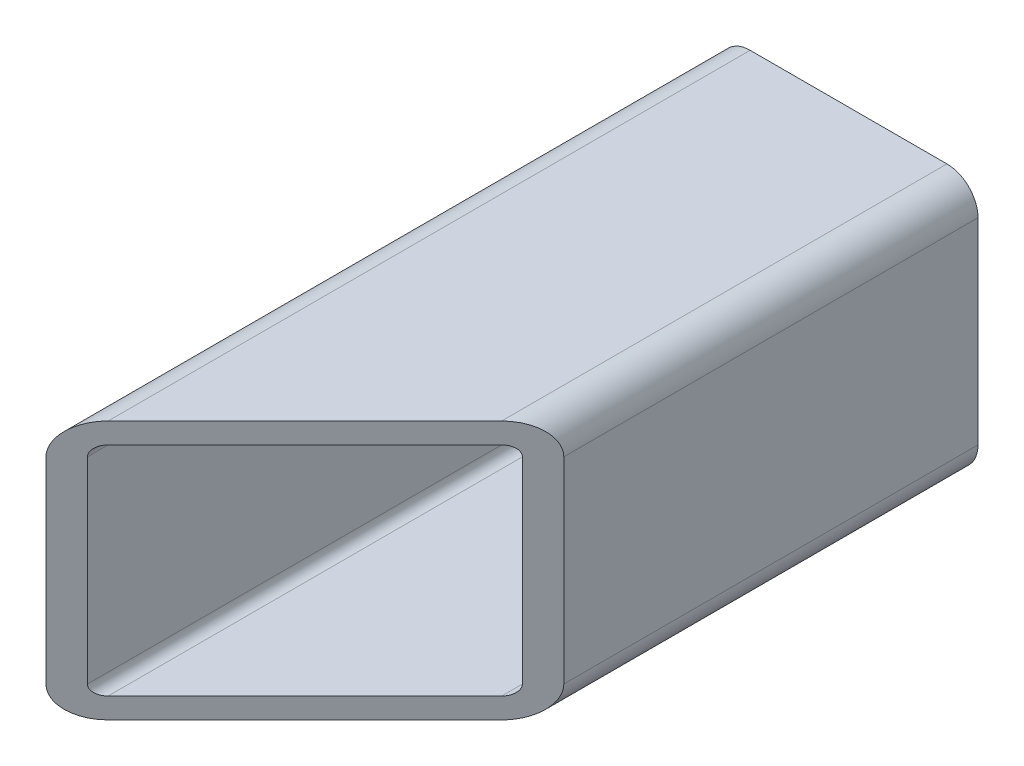
ISO-10303-21;
HEADER;
FILE_DESCRIPTION(('STEP AP214'),'2;1');
FILE_NAME('part.step','',(''),(''),'','','');
FILE_SCHEMA(('AUTOMOTIVE_DESIGN { 1 0 10303 214 1 1 1 1 }'));
ENDSEC;
DATA;
#1=APPLICATION_CONTEXT('core data for automotive mechanical design processes');
#2=APPLICATION_PROTOCOL_DEFINITION('international standard','automotive_design',2000,#1);
#3=PRODUCT_CONTEXT('',#1,'mechanical');
#4=PRODUCT('Part','Part','',(#3));
#5=PRODUCT_RELATED_PRODUCT_CATEGORY('part','',(#4));
#6=PRODUCT_DEFINITION_FORMATION('','',#4);
#7=PRODUCT_DEFINITION_CONTEXT('part definition',#1,'design');
#8=PRODUCT_DEFINITION('design','',#6,#7);
#9=PRODUCT_DEFINITION_SHAPE('','',#8);
#10=(LENGTH_UNIT() NAMED_UNIT(*) SI_UNIT(.MILLI.,.METRE.));
#11=(NAMED_UNIT(*) PLANE_ANGLE_UNIT() SI_UNIT($,.RADIAN.));
#12=(NAMED_UNIT(*) SI_UNIT($,.STERADIAN.) SOLID_ANGLE_UNIT());
#13=UNCERTAINTY_MEASURE_WITH_UNIT(LENGTH_MEASURE(1.E-05),#10,'distance_accuracy_value','');
#14=(GEOMETRIC_REPRESENTATION_CONTEXT(3) GLOBAL_UNCERTAINTY_ASSIGNED_CONTEXT((#13)) GLOBAL_UNIT_ASSIGNED_CONTEXT((#10,
#11,#12)) REPRESENTATION_CONTEXT('',''));
#15=CARTESIAN_POINT('',(0.,0.,0.));
#16=DIRECTION('',(0.,0.,1.));
#17=DIRECTION('',(1.,0.,0.));
#18=AXIS2_PLACEMENT_3D('',#15,#16,#17);
#19=CARTESIAN_POINT('',(0.,0.,0.));
#20=DIRECTION('',(0.,0.,1.));
#21=DIRECTION('',(1.,0.,0.));
#22=AXIS2_PLACEMENT_3D('',#19,#20,#21);
#23=PLANE('',#22);
#24=DIRECTION('',(0.,1.,0.));
#25=VECTOR('',#24,1.);
#26=CARTESIAN_POINT('',(-12.5,-4.75,0.));
#27=LINE('',#26,#25);
#28=CARTESIAN_POINT('',(-12.5,-9.5,0.));
#29=VERTEX_POINT('',#28);
#30=CARTESIAN_POINT('',(-12.5,9.5,0.));
#31=VERTEX_POINT('',#30);
#32=EDGE_CURVE('E11',#29,#31,#27,.T.);
#33=ORIENTED_EDGE('',*,*,#32,.T.);
#34=CARTESIAN_POINT('',(-9.5,9.5,0.));
#35=DIRECTION('',(0.,0.,-1.));
#36=DIRECTION('',(0.,-1.,0.));
#37=AXIS2_PLACEMENT_3D('',#34,#35,#36);
#38=CIRCLE('',#37,3.);
#39=CARTESIAN_POINT('',(-9.5,12.5,0.));
#40=VERTEX_POINT('',#39);
#41=EDGE_CURVE('E248',#31,#40,#38,.T.);
#42=ORIENTED_EDGE('',*,*,#41,.T.);
#43=DIRECTION('',(1.,0.,0.));
#44=VECTOR('',#43,1.);
#45=CARTESIAN_POINT('',(-4.75,12.5,0.));
#46=LINE('',#45,#44);
#47=CARTESIAN_POINT('',(9.5,12.5,0.));
#48=VERTEX_POINT('',#47);
#49=EDGE_CURVE('E279',#40,#48,#46,.T.);
#50=ORIENTED_EDGE('',*,*,#49,.T.);
#51=CARTESIAN_POINT('',(9.5,9.5,0.));
#52=DIRECTION('',(0.,0.,-1.));
#53=DIRECTION('',(-1.,0.,0.));
#54=AXIS2_PLACEMENT_3D('',#51,#52,#53);
#55=CIRCLE('',#54,3.);
#56=CARTESIAN_POINT('',(12.5,9.5,0.));
#57=VERTEX_POINT('',#56);
#58=EDGE_CURVE('E97',#48,#57,#55,.T.);
#59=ORIENTED_EDGE('',*,*,#58,.T.);
#60=DIRECTION('',(0.,-1.,0.));
#61=VECTOR('',#60,1.);
#62=CARTESIAN_POINT('',(12.5,4.75,0.));
#63=LINE('',#62,#61);
#64=CARTESIAN_POINT('',(12.5,-9.5,0.));
#65=VERTEX_POINT('',#64);
#66=EDGE_CURVE('E288',#57,#65,#63,.T.);
#67=ORIENTED_EDGE('',*,*,#66,.T.);
#68=CARTESIAN_POINT('',(9.5,-9.5,0.));
#69=DIRECTION('',(0.,0.,-1.));
#70=DIRECTION('',(0.,1.,0.));
#71=AXIS2_PLACEMENT_3D('',#68,#69,#70);
#72=CIRCLE('',#71,3.);
#73=CARTESIAN_POINT('',(9.5,-12.5,0.));
#74=VERTEX_POINT('',#73);
#75=EDGE_CURVE('E225',#65,#74,#72,.T.);
#76=ORIENTED_EDGE('',*,*,#75,.T.);
#77=DIRECTION('',(-1.,0.,0.));
#78=VECTOR('',#77,1.);
#79=CARTESIAN_POINT('',(4.75,-12.5,0.));
#80=LINE('',#79,#78);
#81=CARTESIAN_POINT('',(-9.5,-12.5,0.));
#82=VERTEX_POINT('',#81);
#83=EDGE_CURVE('E224',#74,#82,#80,.T.);
#84=ORIENTED_EDGE('',*,*,#83,.T.);
#85=CARTESIAN_POINT('',(-9.5,-9.5,0.));
#86=DIRECTION('',(0.,0.,-1.));
#87=DIRECTION('',(1.,0.,0.));
#88=AXIS2_PLACEMENT_3D('',#85,#86,#87);
#89=CIRCLE('',#88,3.);
#90=EDGE_CURVE('E26',#82,#29,#89,.T.);
#91=ORIENTED_EDGE('',*,*,#90,.T.);
#92=EDGE_LOOP('',(#33,#42,#50,#59,#67,#76,#84,#91));
#93=FACE_BOUND('',#92,.T.);
#94=DIRECTION('',(-1.,0.,0.));
#95=VECTOR('',#94,1.);
#96=CARTESIAN_POINT('',(-4.75,10.5,0.));
#97=LINE('',#96,#95);
#98=CARTESIAN_POINT('',(9.5,10.5,0.));
#99=VERTEX_POINT('',#98);
#100=CARTESIAN_POINT('',(-9.5,10.5,0.));
#101=VERTEX_POINT('',#100);
#102=EDGE_CURVE('E179',#99,#101,#97,.T.);
#103=ORIENTED_EDGE('',*,*,#102,.T.);
#104=CARTESIAN_POINT('',(-9.5,9.5,0.));
#105=DIRECTION('',(0.,0.,1.));
#106=DIRECTION('',(0.,-1.,0.));
#107=AXIS2_PLACEMENT_3D('',#104,#105,#106);
#108=CIRCLE('',#107,1.);
#109=CARTESIAN_POINT('',(-10.5,9.5,0.));
#110=VERTEX_POINT('',#109);
#111=EDGE_CURVE('E295',#101,#110,#108,.T.);
#112=ORIENTED_EDGE('',*,*,#111,.T.);
#113=DIRECTION('',(0.,-1.,0.));
#114=VECTOR('',#113,1.);
#115=CARTESIAN_POINT('',(-10.5,-4.75,0.));
#116=LINE('',#115,#114);
#117=CARTESIAN_POINT('',(-10.5,-9.5,0.));
#118=VERTEX_POINT('',#117);
#119=EDGE_CURVE('E265',#110,#118,#116,.T.);
#120=ORIENTED_EDGE('',*,*,#119,.T.);
#121=CARTESIAN_POINT('',(-9.5,-9.5,0.));
#122=DIRECTION('',(0.,0.,1.));
#123=DIRECTION('',(1.,0.,0.));
#124=AXIS2_PLACEMENT_3D('',#121,#122,#123);
#125=CIRCLE('',#124,1.);
#126=CARTESIAN_POINT('',(-9.5,-10.5,0.));
#127=VERTEX_POINT('',#126);
#128=EDGE_CURVE('E216',#118,#127,#125,.T.);
#129=ORIENTED_EDGE('',*,*,#128,.T.);
#130=DIRECTION('',(1.,0.,0.));
#131=VECTOR('',#130,1.);
#132=CARTESIAN_POINT('',(4.75,-10.5,0.));
#133=LINE('',#132,#131);
#134=CARTESIAN_POINT('',(9.5,-10.5,0.));
#135=VERTEX_POINT('',#134);
#136=EDGE_CURVE('E210',#127,#135,#133,.T.);
#137=ORIENTED_EDGE('',*,*,#136,.T.);
#138=CARTESIAN_POINT('',(9.5,-9.5,0.));
#139=DIRECTION('',(0.,0.,1.));
#140=DIRECTION('',(0.,1.,0.));
#141=AXIS2_PLACEMENT_3D('',#138,#139,#140);
#142=CIRCLE('',#141,1.);
#143=CARTESIAN_POINT('',(10.5,-9.5,0.));
#144=VERTEX_POINT('',#143);
#145=EDGE_CURVE('E266',#135,#144,#142,.T.);
#146=ORIENTED_EDGE('',*,*,#145,.T.);
#147=DIRECTION('',(0.,1.,0.));
#148=VECTOR('',#147,1.);
#149=CARTESIAN_POINT('',(10.5,4.75,0.));
#150=LINE('',#149,#148);
#151=CARTESIAN_POINT('',(10.5,9.5,0.));
#152=VERTEX_POINT('',#151);
#153=EDGE_CURVE('E307',#144,#152,#150,.T.);
#154=ORIENTED_EDGE('',*,*,#153,.T.);
#155=CARTESIAN_POINT('',(9.5,9.5,0.));
#156=DIRECTION('',(0.,0.,1.));
#157=DIRECTION('',(-1.,0.,0.));
#158=AXIS2_PLACEMENT_3D('',#155,#156,#157);
#159=CIRCLE('',#158,1.);
#160=EDGE_CURVE('E303',#152,#99,#159,.T.);
#161=ORIENTED_EDGE('',*,*,#160,.T.);
#162=EDGE_LOOP('',(#103,#112,#120,#129,#137,#146,#154,#161));
#163=FACE_BOUND('',#162,.T.);
#164=ADVANCED_FACE('F16',(#93,#163),#23,.F.);
#165=CARTESIAN_POINT('',(-12.5,-9.5,0.));
#166=DIRECTION('',(-1.,0.,0.));
#167=DIRECTION('',(0.,1.,0.));
#168=AXIS2_PLACEMENT_3D('',#165,#166,#167);
#169=PLANE('',#168);
#170=DIRECTION('',(0.,1.,0.));
#171=VECTOR('',#170,1.);
#172=CARTESIAN_POINT('',(-12.5,-4.75,65.0000001));
#173=LINE('',#172,#171);
#174=CARTESIAN_POINT('',(-12.5,-9.5,65.0000001));
#175=VERTEX_POINT('',#174);
#176=CARTESIAN_POINT('',(-12.5,9.5,65.0000001));
#177=VERTEX_POINT('',#176);
#178=EDGE_CURVE('E261',#175,#177,#173,.T.);
#179=ORIENTED_EDGE('',*,*,#178,.T.);
#180=DIRECTION('',(0.,0.,1.));
#181=VECTOR('',#180,1.);
#182=CARTESIAN_POINT('',(-12.5,9.5,0.));
#183=LINE('',#182,#181);
#184=EDGE_CURVE('E280',#31,#177,#183,.T.);
#185=ORIENTED_EDGE('',*,*,#184,.F.);
#186=ORIENTED_EDGE('',*,*,#32,.F.);
#187=DIRECTION('',(0.,0.,1.));
#188=VECTOR('',#187,1.);
#189=CARTESIAN_POINT('',(-12.5,-9.5,0.));
#190=LINE('',#189,#188);
#191=EDGE_CURVE('E284',#29,#175,#190,.T.);
#192=ORIENTED_EDGE('',*,*,#191,.T.);
#193=EDGE_LOOP('',(#179,#185,#186,#192));
#194=FACE_BOUND('',#193,.T.);
#195=ADVANCED_FACE('F18',(#194),#169,.T.);
#196=CARTESIAN_POINT('',(-9.5,-9.5,0.));
#197=DIRECTION('',(0.,0.,1.));
#198=DIRECTION('',(1.,0.,0.));
#199=AXIS2_PLACEMENT_3D('',#196,#197,#198);
#200=CYLINDRICAL_SURFACE('',#199,3.);
#201=CARTESIAN_POINT('',(-9.5,-9.5,62.));
#202=DIRECTION('',(-0.707106781186548,0.,-0.707106781186548));
#203=DIRECTION('',(0.707106781186548,0.,-0.707106781186548));
#204=AXIS2_PLACEMENT_3D('',#201,#202,#203);
#205=ELLIPSE('',#204,4.24264068711929,3.);
#206=CARTESIAN_POINT('',(-9.5,-12.5,62.));
#207=VERTEX_POINT('',#206);
#208=EDGE_CURVE('E254',#207,#175,#205,.T.);
#209=ORIENTED_EDGE('',*,*,#208,.T.);
#210=ORIENTED_EDGE('',*,*,#191,.F.);
#211=ORIENTED_EDGE('',*,*,#90,.F.);
#212=DIRECTION('',(0.,0.,1.));
#213=VECTOR('',#212,1.);
#214=CARTESIAN_POINT('',(-9.5,-12.5,0.));
#215=LINE('',#214,#213);
#216=EDGE_CURVE('E222',#82,#207,#215,.T.);
#217=ORIENTED_EDGE('',*,*,#216,.T.);
#218=EDGE_LOOP('',(#209,#210,#211,#217));
#219=FACE_BOUND('',#218,.T.);
#220=ADVANCED_FACE('F426',(#219),#200,.T.);
#221=CARTESIAN_POINT('',(9.5,-12.5,0.));
#222=DIRECTION('',(0.,-1.,0.));
#223=DIRECTION('',(0.,0.,-1.));
#224=AXIS2_PLACEMENT_3D('',#221,#222,#223);
#225=PLANE('',#224);
#226=DIRECTION('',(-0.707106781186547,0.,0.707106781186548));
#227=VECTOR('',#226,1.);
#228=CARTESIAN_POINT('',(28.625,-12.5,23.875));
#229=LINE('',#228,#227);
#230=CARTESIAN_POINT('',(9.5,-12.5,43.));
#231=VERTEX_POINT('',#230);
#232=EDGE_CURVE('E249',#231,#207,#229,.T.);
#233=ORIENTED_EDGE('',*,*,#232,.T.);
#234=ORIENTED_EDGE('',*,*,#216,.F.);
#235=ORIENTED_EDGE('',*,*,#83,.F.);
#236=DIRECTION('',(0.,0.,1.));
#237=VECTOR('',#236,1.);
#238=CARTESIAN_POINT('',(9.5,-12.5,0.));
#239=LINE('',#238,#237);
#240=EDGE_CURVE('E285',#74,#231,#239,.T.);
#241=ORIENTED_EDGE('',*,*,#240,.T.);
#242=EDGE_LOOP('',(#233,#234,#235,#241));
#243=FACE_BOUND('',#242,.T.);
#244=ADVANCED_FACE('F440',(#243),#225,.T.);
#245=CARTESIAN_POINT('',(9.5,-9.5,0.));
#246=DIRECTION('',(0.,0.,1.));
#247=DIRECTION('',(0.,1.,0.));
#248=AXIS2_PLACEMENT_3D('',#245,#246,#247);
#249=CYLINDRICAL_SURFACE('',#248,3.);
#250=CARTESIAN_POINT('',(9.5,-9.5,43.));
#251=DIRECTION('',(-0.707106781186548,0.,-0.707106781186548));
#252=DIRECTION('',(-0.707106781186548,0.,0.707106781186548));
#253=AXIS2_PLACEMENT_3D('',#250,#251,#252);
#254=ELLIPSE('',#253,4.24264068711929,3.);
#255=CARTESIAN_POINT('',(12.5,-9.5,40.));
#256=VERTEX_POINT('',#255);
#257=EDGE_CURVE('E253',#256,#231,#254,.T.);
#258=ORIENTED_EDGE('',*,*,#257,.T.);
#259=ORIENTED_EDGE('',*,*,#240,.F.);
#260=ORIENTED_EDGE('',*,*,#75,.F.);
#261=DIRECTION('',(0.,0.,1.));
#262=VECTOR('',#261,1.);
#263=CARTESIAN_POINT('',(12.5,-9.5,0.));
#264=LINE('',#263,#262);
#265=EDGE_CURVE('E306',#65,#256,#264,.T.);
#266=ORIENTED_EDGE('',*,*,#265,.T.);
#267=EDGE_LOOP('',(#258,#259,#260,#266));
#268=FACE_BOUND('',#267,.T.);
#269=ADVANCED_FACE('F443',(#268),#249,.T.);
#270=CARTESIAN_POINT('',(12.5,9.5,0.));
#271=DIRECTION('',(1.,0.,0.));
#272=DIRECTION('',(0.,1.,0.));
#273=AXIS2_PLACEMENT_3D('',#270,#271,#272);
#274=PLANE('',#273);
#275=DIRECTION('',(0.,-1.,0.));
#276=VECTOR('',#275,1.);
#277=CARTESIAN_POINT('',(12.5,4.75,40.));
#278=LINE('',#277,#276);
#279=CARTESIAN_POINT('',(12.5,9.5,40.));
#280=VERTEX_POINT('',#279);
#281=EDGE_CURVE('E270',#280,#256,#278,.T.);
#282=ORIENTED_EDGE('',*,*,#281,.T.);
#283=ORIENTED_EDGE('',*,*,#265,.F.);
#284=ORIENTED_EDGE('',*,*,#66,.F.);
#285=DIRECTION('',(0.,0.,1.));
#286=VECTOR('',#285,1.);
#287=CARTESIAN_POINT('',(12.5,9.5,0.));
#288=LINE('',#287,#286);
#289=EDGE_CURVE('E302',#57,#280,#288,.T.);
#290=ORIENTED_EDGE('',*,*,#289,.T.);
#291=EDGE_LOOP('',(#282,#283,#284,#290));
#292=FACE_BOUND('',#291,.T.);
#293=ADVANCED_FACE('F429',(#292),#274,.T.);
#294=CARTESIAN_POINT('',(9.5,9.5,0.));
#295=DIRECTION('',(0.,0.,1.));
#296=DIRECTION('',(-1.,0.,0.));
#297=AXIS2_PLACEMENT_3D('',#294,#295,#296);
#298=CYLINDRICAL_SURFACE('',#297,1.);
#299=CARTESIAN_POINT('',(9.5,9.5,43.));
#300=DIRECTION('',(0.707106781186548,0.,0.707106781186547));
#301=DIRECTION('',(-0.707106781186547,0.,0.707106781186548));
#302=AXIS2_PLACEMENT_3D('',#299,#300,#301);
#303=ELLIPSE('',#302,1.4142135623731,1.);
#304=CARTESIAN_POINT('',(10.5,9.5,42.));
#305=VERTEX_POINT('',#304);
#306=CARTESIAN_POINT('',(9.5,10.5,43.));
#307=VERTEX_POINT('',#306);
#308=EDGE_CURVE('E185',#305,#307,#303,.T.);
#309=ORIENTED_EDGE('',*,*,#308,.T.);
#310=DIRECTION('',(0.,0.,1.));
#311=VECTOR('',#310,1.);
#312=CARTESIAN_POINT('',(9.5,10.5,0.));
#313=LINE('',#312,#311);
#314=EDGE_CURVE('E172',#99,#307,#313,.T.);
#315=ORIENTED_EDGE('',*,*,#314,.F.);
#316=ORIENTED_EDGE('',*,*,#160,.F.);
#317=DIRECTION('',(0.,0.,1.));
#318=VECTOR('',#317,1.);
#319=CARTESIAN_POINT('',(10.5,9.5,0.));
#320=LINE('',#319,#318);
#321=EDGE_CURVE('E188',#152,#305,#320,.T.);
#322=ORIENTED_EDGE('',*,*,#321,.T.);
#323=EDGE_LOOP('',(#309,#315,#316,#322));
#324=FACE_BOUND('',#323,.T.);
#325=ADVANCED_FACE('F186',(#324),#298,.F.);
#326=CARTESIAN_POINT('',(10.5,9.5,0.));
#327=DIRECTION('',(1.,0.,0.));
#328=DIRECTION('',(0.,-1.,0.));
#329=AXIS2_PLACEMENT_3D('',#326,#327,#328);
#330=PLANE('',#329);
#331=DIRECTION('',(0.,1.,0.));
#332=VECTOR('',#331,1.);
#333=CARTESIAN_POINT('',(10.5,4.75,42.));
#334=LINE('',#333,#332);
#335=CARTESIAN_POINT('',(10.5,-9.5,42.));
#336=VERTEX_POINT('',#335);
#337=EDGE_CURVE('E193',#336,#305,#334,.T.);
#338=ORIENTED_EDGE('',*,*,#337,.T.);
#339=ORIENTED_EDGE('',*,*,#321,.F.);
#340=ORIENTED_EDGE('',*,*,#153,.F.);
#341=DIRECTION('',(0.,0.,1.));
#342=VECTOR('',#341,1.);
#343=CARTESIAN_POINT('',(10.5,-9.5,0.));
#344=LINE('',#343,#342);
#345=EDGE_CURVE('E214',#144,#336,#344,.T.);
#346=ORIENTED_EDGE('',*,*,#345,.T.);
#347=EDGE_LOOP('',(#338,#339,#340,#346));
#348=FACE_BOUND('',#347,.T.);
#349=ADVANCED_FACE('F363',(#348),#330,.F.);
#350=CARTESIAN_POINT('',(9.5,-9.5,0.));
#351=DIRECTION('',(0.,0.,1.));
#352=DIRECTION('',(0.,1.,0.));
#353=AXIS2_PLACEMENT_3D('',#350,#351,#352);
#354=CYLINDRICAL_SURFACE('',#353,1.);
#355=CARTESIAN_POINT('',(9.5,-9.5,43.));
#356=DIRECTION('',(0.707106781186548,0.,0.707106781186547));
#357=DIRECTION('',(-0.707106781186547,0.,0.707106781186548));
#358=AXIS2_PLACEMENT_3D('',#355,#356,#357);
#359=ELLIPSE('',#358,1.4142135623731,1.);
#360=CARTESIAN_POINT('',(9.5,-10.5,43.));
#361=VERTEX_POINT('',#360);
#362=EDGE_CURVE('E275',#361,#336,#359,.T.);
#363=ORIENTED_EDGE('',*,*,#362,.T.);
#364=ORIENTED_EDGE('',*,*,#345,.F.);
#365=ORIENTED_EDGE('',*,*,#145,.F.);
#366=DIRECTION('',(0.,0.,1.));
#367=VECTOR('',#366,1.);
#368=CARTESIAN_POINT('',(9.5,-10.5,0.));
#369=LINE('',#368,#367);
#370=EDGE_CURVE('E215',#135,#361,#369,.T.);
#371=ORIENTED_EDGE('',*,*,#370,.T.);
#372=EDGE_LOOP('',(#363,#364,#365,#371));
#373=FACE_BOUND('',#372,.T.);
#374=ADVANCED_FACE('F436',(#373),#354,.F.);
#375=CARTESIAN_POINT('',(9.5,-10.5,0.));
#376=DIRECTION('',(0.,-1.,0.));
#377=DIRECTION('',(0.,0.,-1.));
#378=AXIS2_PLACEMENT_3D('',#375,#376,#377);
#379=PLANE('',#378);
#380=DIRECTION('',(0.707106781186547,0.,-0.707106781186548));
#381=VECTOR('',#380,1.);
#382=CARTESIAN_POINT('',(28.625,-10.5,23.875));
#383=LINE('',#382,#381);
#384=CARTESIAN_POINT('',(-9.5,-10.5,62.));
#385=VERTEX_POINT('',#384);
#386=EDGE_CURVE('E236',#385,#361,#383,.T.);
#387=ORIENTED_EDGE('',*,*,#386,.T.);
#388=ORIENTED_EDGE('',*,*,#370,.F.);
#389=ORIENTED_EDGE('',*,*,#136,.F.);
#390=DIRECTION('',(0.,0.,1.));
#391=VECTOR('',#390,1.);
#392=CARTESIAN_POINT('',(-9.5,-10.5,0.));
#393=LINE('',#392,#391);
#394=EDGE_CURVE('E221',#127,#385,#393,.T.);
#395=ORIENTED_EDGE('',*,*,#394,.T.);
#396=EDGE_LOOP('',(#387,#388,#389,#395));
#397=FACE_BOUND('',#396,.T.);
#398=ADVANCED_FACE('F368',(#397),#379,.F.);
#399=CARTESIAN_POINT('',(9.5,9.5,0.));
#400=DIRECTION('',(0.,0.,1.));
#401=DIRECTION('',(-1.,0.,0.));
#402=AXIS2_PLACEMENT_3D('',#399,#400,#401);
#403=CYLINDRICAL_SURFACE('',#402,3.);
#404=CARTESIAN_POINT('',(9.5,9.5,43.));
#405=DIRECTION('',(-0.707106781186548,0.,-0.707106781186548));
#406=DIRECTION('',(-0.707106781186548,0.,0.707106781186548));
#407=AXIS2_PLACEMENT_3D('',#404,#405,#406);
#408=ELLIPSE('',#407,4.24264068711929,3.);
#409=CARTESIAN_POINT('',(9.5,12.5,43.));
#410=VERTEX_POINT('',#409);
#411=EDGE_CURVE('E274',#410,#280,#408,.T.);
#412=ORIENTED_EDGE('',*,*,#411,.T.);
#413=ORIENTED_EDGE('',*,*,#289,.F.);
#414=ORIENTED_EDGE('',*,*,#58,.F.);
#415=DIRECTION('',(0.,0.,1.));
#416=VECTOR('',#415,1.);
#417=CARTESIAN_POINT('',(9.5,12.5,0.));
#418=LINE('',#417,#416);
#419=EDGE_CURVE('E276',#48,#410,#418,.T.);
#420=ORIENTED_EDGE('',*,*,#419,.T.);
#421=EDGE_LOOP('',(#412,#413,#414,#420));
#422=FACE_BOUND('',#421,.T.);
#423=ADVANCED_FACE('F431',(#422),#403,.T.);
#424=CARTESIAN_POINT('',(-9.5,12.5,0.));
#425=DIRECTION('',(0.,1.,0.));
#426=DIRECTION('',(1.,0.,0.));
#427=AXIS2_PLACEMENT_3D('',#424,#425,#426);
#428=PLANE('',#427);
#429=DIRECTION('',(0.707106781186548,0.,-0.707106781186548));
#430=VECTOR('',#429,1.);
#431=CARTESIAN_POINT('',(23.875,12.5,28.625));
#432=LINE('',#431,#430);
#433=CARTESIAN_POINT('',(-9.5,12.5,62.));
#434=VERTEX_POINT('',#433);
#435=EDGE_CURVE('E317',#434,#410,#432,.T.);
#436=ORIENTED_EDGE('',*,*,#435,.T.);
#437=ORIENTED_EDGE('',*,*,#419,.F.);
#438=ORIENTED_EDGE('',*,*,#49,.F.);
#439=DIRECTION('',(0.,0.,1.));
#440=VECTOR('',#439,1.);
#441=CARTESIAN_POINT('',(-9.5,12.5,0.));
#442=LINE('',#441,#440);
#443=EDGE_CURVE('E220',#40,#434,#442,.T.);
#444=ORIENTED_EDGE('',*,*,#443,.T.);
#445=EDGE_LOOP('',(#436,#437,#438,#444));
#446=FACE_BOUND('',#445,.T.);
#447=ADVANCED_FACE('F434',(#446),#428,.T.);
#448=CARTESIAN_POINT('',(-9.5,9.5,0.));
#449=DIRECTION('',(0.,0.,1.));
#450=DIRECTION('',(0.,-1.,0.));
#451=AXIS2_PLACEMENT_3D('',#448,#449,#450);
#452=CYLINDRICAL_SURFACE('',#451,3.);
#453=CARTESIAN_POINT('',(-9.5,9.5,62.));
#454=DIRECTION('',(-0.707106781186548,0.,-0.707106781186548));
#455=DIRECTION('',(0.707106781186548,0.,-0.707106781186548));
#456=AXIS2_PLACEMENT_3D('',#453,#454,#455);
#457=ELLIPSE('',#456,4.24264068711929,3.);
#458=EDGE_CURVE('E292',#177,#434,#457,.T.);
#459=ORIENTED_EDGE('',*,*,#458,.T.);
#460=ORIENTED_EDGE('',*,*,#443,.F.);
#461=ORIENTED_EDGE('',*,*,#41,.F.);
#462=ORIENTED_EDGE('',*,*,#184,.T.);
#463=EDGE_LOOP('',(#459,#460,#461,#462));
#464=FACE_BOUND('',#463,.T.);
#465=ADVANCED_FACE('F418',(#464),#452,.T.);
#466=CARTESIAN_POINT('',(-9.5,-9.5,0.));
#467=DIRECTION('',(0.,0.,1.));
#468=DIRECTION('',(1.,0.,0.));
#469=AXIS2_PLACEMENT_3D('',#466,#467,#468);
#470=CYLINDRICAL_SURFACE('',#469,1.);
#471=CARTESIAN_POINT('',(-9.5,-9.5,62.));
#472=DIRECTION('',(0.707106781186548,0.,0.707106781186547));
#473=DIRECTION('',(0.707106781186547,0.,-0.707106781186548));
#474=AXIS2_PLACEMENT_3D('',#471,#472,#473);
#475=ELLIPSE('',#474,1.4142135623731,1.);
#476=CARTESIAN_POINT('',(-10.5,-9.5,63.));
#477=VERTEX_POINT('',#476);
#478=EDGE_CURVE('E228',#477,#385,#475,.T.);
#479=ORIENTED_EDGE('',*,*,#478,.T.);
#480=ORIENTED_EDGE('',*,*,#394,.F.);
#481=ORIENTED_EDGE('',*,*,#128,.F.);
#482=DIRECTION('',(0.,0.,1.));
#483=VECTOR('',#482,1.);
#484=CARTESIAN_POINT('',(-10.5,-9.5,0.));
#485=LINE('',#484,#483);
#486=EDGE_CURVE('E299',#118,#477,#485,.T.);
#487=ORIENTED_EDGE('',*,*,#486,.T.);
#488=EDGE_LOOP('',(#479,#480,#481,#487));
#489=FACE_BOUND('',#488,.T.);
#490=ADVANCED_FACE('F370',(#489),#470,.F.);
#491=CARTESIAN_POINT('',(-10.5,-9.5,0.));
#492=DIRECTION('',(-1.,0.,0.));
#493=DIRECTION('',(0.,0.,1.));
#494=AXIS2_PLACEMENT_3D('',#491,#492,#493);
#495=PLANE('',#494);
#496=DIRECTION('',(0.,-1.,0.));
#497=VECTOR('',#496,1.);
#498=CARTESIAN_POINT('',(-10.5,-4.75,63.));
#499=LINE('',#498,#497);
#500=CARTESIAN_POINT('',(-10.5,9.5,63.));
#501=VERTEX_POINT('',#500);
#502=EDGE_CURVE('E205',#501,#477,#499,.T.);
#503=ORIENTED_EDGE('',*,*,#502,.T.);
#504=ORIENTED_EDGE('',*,*,#486,.F.);
#505=ORIENTED_EDGE('',*,*,#119,.F.);
#506=DIRECTION('',(0.,0.,1.));
#507=VECTOR('',#506,1.);
#508=CARTESIAN_POINT('',(-10.5,9.5,0.));
#509=LINE('',#508,#507);
#510=EDGE_CURVE('E182',#110,#501,#509,.T.);
#511=ORIENTED_EDGE('',*,*,#510,.T.);
#512=EDGE_LOOP('',(#503,#504,#505,#511));
#513=FACE_BOUND('',#512,.T.);
#514=ADVANCED_FACE('F408',(#513),#495,.F.);
#515=CARTESIAN_POINT('',(-9.5,9.5,0.));
#516=DIRECTION('',(0.,0.,1.));
#517=DIRECTION('',(0.,-1.,0.));
#518=AXIS2_PLACEMENT_3D('',#515,#516,#517);
#519=CYLINDRICAL_SURFACE('',#518,1.);
#520=CARTESIAN_POINT('',(-9.5,9.5,62.));
#521=DIRECTION('',(0.707106781186548,0.,0.707106781186547));
#522=DIRECTION('',(0.707106781186547,0.,-0.707106781186548));
#523=AXIS2_PLACEMENT_3D('',#520,#521,#522);
#524=ELLIPSE('',#523,1.4142135623731,1.);
#525=CARTESIAN_POINT('',(-9.5,10.5,62.));
#526=VERTEX_POINT('',#525);
#527=EDGE_CURVE('E198',#526,#501,#524,.T.);
#528=ORIENTED_EDGE('',*,*,#527,.T.);
#529=ORIENTED_EDGE('',*,*,#510,.F.);
#530=ORIENTED_EDGE('',*,*,#111,.F.);
#531=DIRECTION('',(0.,0.,1.));
#532=VECTOR('',#531,1.);
#533=CARTESIAN_POINT('',(-9.5,10.5,0.));
#534=LINE('',#533,#532);
#535=EDGE_CURVE('E164',#101,#526,#534,.T.);
#536=ORIENTED_EDGE('',*,*,#535,.T.);
#537=EDGE_LOOP('',(#528,#529,#530,#536));
#538=FACE_BOUND('',#537,.T.);
#539=ADVANCED_FACE('F410',(#538),#519,.F.);
#540=CARTESIAN_POINT('',(-9.5,10.5,0.));
#541=DIRECTION('',(0.,1.,0.));
#542=DIRECTION('',(1.,0.,0.));
#543=AXIS2_PLACEMENT_3D('',#540,#541,#542);
#544=PLANE('',#543);
#545=DIRECTION('',(-0.707106781186548,0.,0.707106781186548));
#546=VECTOR('',#545,1.);
#547=CARTESIAN_POINT('',(23.875,10.5,28.625));
#548=LINE('',#547,#546);
#549=EDGE_CURVE('E176',#307,#526,#548,.T.);
#550=ORIENTED_EDGE('',*,*,#549,.T.);
#551=ORIENTED_EDGE('',*,*,#535,.F.);
#552=ORIENTED_EDGE('',*,*,#102,.F.);
#553=ORIENTED_EDGE('',*,*,#314,.T.);
#554=EDGE_LOOP('',(#550,#551,#552,#553));
#555=FACE_BOUND('',#554,.T.);
#556=ADVANCED_FACE('F174',(#555),#544,.F.);
#557=CARTESIAN_POINT('',(26.25,0.,26.25));
#558=DIRECTION('',(-0.707106781186548,0.,-0.707106781186547));
#559=DIRECTION('',(-0.707106781186547,0.,0.707106781186548));
#560=AXIS2_PLACEMENT_3D('',#557,#558,#559);
#561=PLANE('',#560);
#562=ORIENTED_EDGE('',*,*,#281,.F.);
#563=ORIENTED_EDGE('',*,*,#411,.F.);
#564=ORIENTED_EDGE('',*,*,#435,.F.);
#565=ORIENTED_EDGE('',*,*,#458,.F.);
#566=ORIENTED_EDGE('',*,*,#178,.F.);
#567=ORIENTED_EDGE('',*,*,#208,.F.);
#568=ORIENTED_EDGE('',*,*,#232,.F.);
#569=ORIENTED_EDGE('',*,*,#257,.F.);
#570=EDGE_LOOP('',(#562,#563,#564,#565,#566,#567,#568,#569));
#571=FACE_BOUND('',#570,.T.);
#572=ORIENTED_EDGE('',*,*,#386,.F.);
#573=ORIENTED_EDGE('',*,*,#478,.F.);
#574=ORIENTED_EDGE('',*,*,#502,.F.);
#575=ORIENTED_EDGE('',*,*,#527,.F.);
#576=ORIENTED_EDGE('',*,*,#549,.F.);
#577=ORIENTED_EDGE('',*,*,#308,.F.);
#578=ORIENTED_EDGE('',*,*,#337,.F.);
#579=ORIENTED_EDGE('',*,*,#362,.F.);
#580=EDGE_LOOP('',(#572,#573,#574,#575,#576,#577,#578,#579));
#581=FACE_BOUND('',#580,.T.);
#582=ADVANCED_FACE('F196',(#571,#581),#561,.F.);
#583=CLOSED_SHELL('',(#164,#195,#220,#244,#269,#293,#325,#349,#374,#398,#423,#447,#465,#490,
#514,#539,#556,#582));
#584=MANIFOLD_SOLID_BREP('B1',#583);
#585=ADVANCED_BREP_SHAPE_REPRESENTATION('',(#18,#584),#14);
#586=SHAPE_DEFINITION_REPRESENTATION(#9,#585);
ENDSEC;
END-ISO-10303-21;
